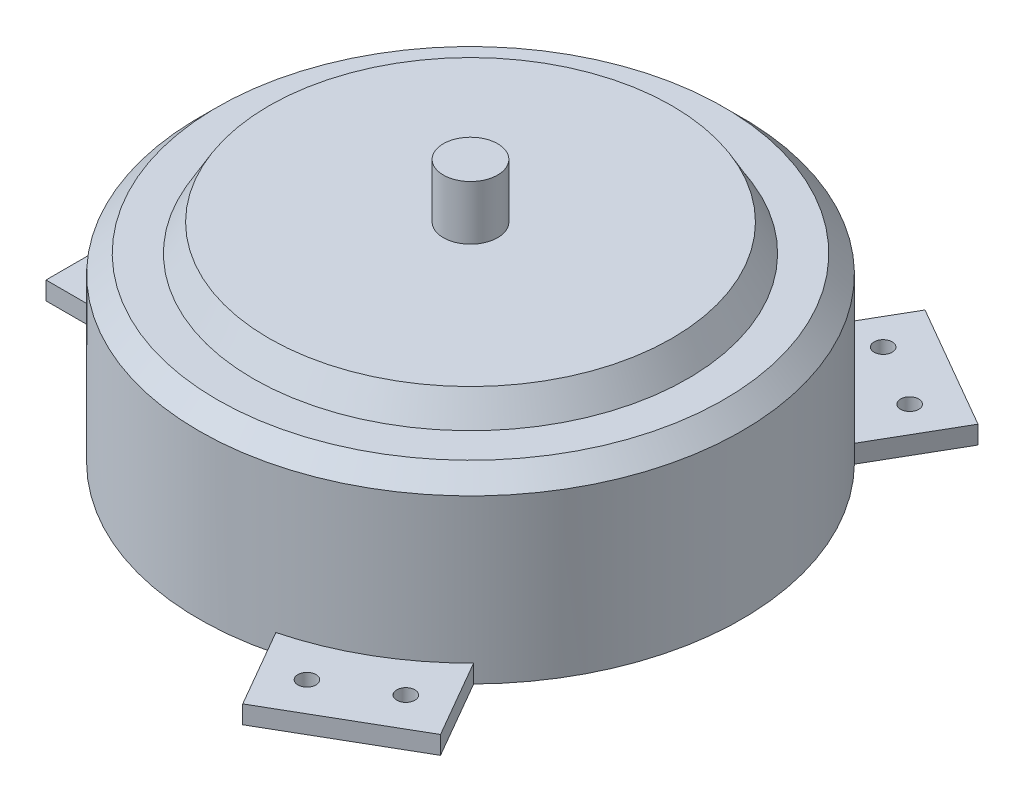
ISO-10303-21;
HEADER;
FILE_DESCRIPTION(('STEP AP214'),'2;1');
FILE_NAME('part.step','',(''),(''),'','','');
FILE_SCHEMA(('AUTOMOTIVE_DESIGN { 1 0 10303 214 1 1 1 1 }'));
ENDSEC;
DATA;
#1=APPLICATION_CONTEXT('core data for automotive mechanical design processes');
#2=APPLICATION_PROTOCOL_DEFINITION('international standard','automotive_design',2000,#1);
#3=PRODUCT_CONTEXT('',#1,'mechanical');
#4=PRODUCT('Part','Part','',(#3));
#5=PRODUCT_RELATED_PRODUCT_CATEGORY('part','',(#4));
#6=PRODUCT_DEFINITION_FORMATION('','',#4);
#7=PRODUCT_DEFINITION_CONTEXT('part definition',#1,'design');
#8=PRODUCT_DEFINITION('design','',#6,#7);
#9=PRODUCT_DEFINITION_SHAPE('','',#8);
#10=(LENGTH_UNIT() NAMED_UNIT(*) SI_UNIT(.MILLI.,.METRE.));
#11=(NAMED_UNIT(*) PLANE_ANGLE_UNIT() SI_UNIT($,.RADIAN.));
#12=(NAMED_UNIT(*) SI_UNIT($,.STERADIAN.) SOLID_ANGLE_UNIT());
#13=UNCERTAINTY_MEASURE_WITH_UNIT(LENGTH_MEASURE(1.E-05),#10,'distance_accuracy_value','');
#14=(GEOMETRIC_REPRESENTATION_CONTEXT(3) GLOBAL_UNCERTAINTY_ASSIGNED_CONTEXT((#13)) GLOBAL_UNIT_ASSIGNED_CONTEXT((#10,
#11,#12)) REPRESENTATION_CONTEXT('',''));
#15=CARTESIAN_POINT('',(0.,0.,0.));
#16=DIRECTION('',(0.,0.,1.));
#17=DIRECTION('',(1.,0.,0.));
#18=AXIS2_PLACEMENT_3D('',#15,#16,#17);
#19=CARTESIAN_POINT('',(0.,100.,0.));
#20=DIRECTION('',(0.,-1.,0.));
#21=DIRECTION('',(0.,0.,-1.));
#22=AXIS2_PLACEMENT_3D('',#19,#20,#21);
#23=CYLINDRICAL_SURFACE('',#22,150.);
#24=CARTESIAN_POINT('',(0.,89.9999999999999,0.));
#25=DIRECTION('',(0.,1.,0.));
#26=DIRECTION('',(0.,0.,1.));
#27=AXIS2_PLACEMENT_3D('',#24,#25,#26);
#28=CIRCLE('',#27,150.);
#29=CARTESIAN_POINT('',(0.,89.9999999999999,150.));
#30=VERTEX_POINT('',#29);
#31=EDGE_CURVE('E52',#30,#30,#28,.F.);
#32=ORIENTED_EDGE('',*,*,#31,.T.);
#33=EDGE_LOOP('',(#32));
#34=FACE_BOUND('',#33,.T.);
#35=DIRECTION('',(0.,-1.,0.));
#36=VECTOR('',#35,1.);
#37=CARTESIAN_POINT('',(106.925177625381,10.,-105.19984025549));
#38=LINE('',#37,#36);
#39=CARTESIAN_POINT('',(106.925177625381,9.99999999999999,-105.19984025549));
#40=VERTEX_POINT('',#39);
#41=CARTESIAN_POINT('',(106.925177625381,0.,-105.19984025549));
#42=VERTEX_POINT('',#41);
#43=EDGE_CURVE('E70',#40,#42,#38,.T.);
#44=ORIENTED_EDGE('',*,*,#43,.F.);
#45=CARTESIAN_POINT('',(0.,10.,0.));
#46=DIRECTION('',(0.,1.,0.));
#47=DIRECTION('',(-0.866025403784443,0.,-0.499999999999992));
#48=AXIS2_PLACEMENT_3D('',#45,#46,#47);
#49=CIRCLE('',#48,150.);
#50=CARTESIAN_POINT('',(37.6431453226259,9.99999999999999,-145.19984025549));
#51=VERTEX_POINT('',#50);
#52=EDGE_CURVE('E65',#40,#51,#49,.T.);
#53=ORIENTED_EDGE('',*,*,#52,.T.);
#54=DIRECTION('',(0.,-1.,0.));
#55=VECTOR('',#54,1.);
#56=CARTESIAN_POINT('',(37.6431453226259,10.,-145.19984025549));
#57=LINE('',#56,#55);
#58=CARTESIAN_POINT('',(37.6431453226259,0.,-145.19984025549));
#59=VERTEX_POINT('',#58);
#60=EDGE_CURVE('E181',#51,#59,#57,.T.);
#61=ORIENTED_EDGE('',*,*,#60,.T.);
#62=CARTESIAN_POINT('',(0.,0.,0.));
#63=DIRECTION('',(0.,1.,0.));
#64=DIRECTION('',(0.,0.,1.));
#65=AXIS2_PLACEMENT_3D('',#62,#63,#64);
#66=CIRCLE('',#65,150.);
#67=CARTESIAN_POINT('',(-144.56832294801,0.,-40.));
#68=VERTEX_POINT('',#67);
#69=EDGE_CURVE('E281',#59,#68,#66,.T.);
#70=ORIENTED_EDGE('',*,*,#69,.T.);
#71=DIRECTION('',(0.,-1.,0.));
#72=VECTOR('',#71,1.);
#73=CARTESIAN_POINT('',(-144.56832294801,10.,-40.));
#74=LINE('',#73,#72);
#75=CARTESIAN_POINT('',(-144.56832294801,9.99999999999999,-40.));
#76=VERTEX_POINT('',#75);
#77=EDGE_CURVE('E257',#76,#68,#74,.T.);
#78=ORIENTED_EDGE('',*,*,#77,.F.);
#79=CARTESIAN_POINT('',(0.,10.,0.));
#80=DIRECTION('',(0.,1.,0.));
#81=DIRECTION('',(0.,0.,1.));
#82=AXIS2_PLACEMENT_3D('',#79,#80,#81);
#83=CIRCLE('',#82,150.);
#84=CARTESIAN_POINT('',(-144.56832294801,9.99999999999999,40.));
#85=VERTEX_POINT('',#84);
#86=EDGE_CURVE('E254',#76,#85,#83,.T.);
#87=ORIENTED_EDGE('',*,*,#86,.T.);
#88=DIRECTION('',(0.,-1.,0.));
#89=VECTOR('',#88,1.);
#90=CARTESIAN_POINT('',(-144.56832294801,10.,40.));
#91=LINE('',#90,#89);
#92=CARTESIAN_POINT('',(-144.56832294801,0.,40.));
#93=VERTEX_POINT('',#92);
#94=EDGE_CURVE('E271',#85,#93,#91,.T.);
#95=ORIENTED_EDGE('',*,*,#94,.T.);
#96=CARTESIAN_POINT('',(37.6431453226279,0.,145.199840255489));
#97=VERTEX_POINT('',#96);
#98=EDGE_CURVE('E282',#93,#97,#66,.T.);
#99=ORIENTED_EDGE('',*,*,#98,.T.);
#100=DIRECTION('',(0.,-1.,0.));
#101=VECTOR('',#100,1.);
#102=CARTESIAN_POINT('',(37.6431453226279,10.,145.199840255489));
#103=LINE('',#102,#101);
#104=CARTESIAN_POINT('',(37.6431453226279,9.99999999999999,145.199840255489));
#105=VERTEX_POINT('',#104);
#106=EDGE_CURVE('E201',#105,#97,#103,.T.);
#107=ORIENTED_EDGE('',*,*,#106,.F.);
#108=CARTESIAN_POINT('',(0.,10.,0.));
#109=DIRECTION('',(0.,1.,0.));
#110=DIRECTION('',(0.866025403784436,0.,-0.500000000000004));
#111=AXIS2_PLACEMENT_3D('',#108,#109,#110);
#112=CIRCLE('',#111,150.);
#113=CARTESIAN_POINT('',(106.925177625383,9.99999999999999,105.199840255489));
#114=VERTEX_POINT('',#113);
#115=EDGE_CURVE('E198',#105,#114,#112,.T.);
#116=ORIENTED_EDGE('',*,*,#115,.T.);
#117=DIRECTION('',(0.,-1.,0.));
#118=VECTOR('',#117,1.);
#119=CARTESIAN_POINT('',(106.925177625383,10.,105.199840255489));
#120=LINE('',#119,#118);
#121=CARTESIAN_POINT('',(106.925177625383,0.,105.199840255489));
#122=VERTEX_POINT('',#121);
#123=EDGE_CURVE('E215',#114,#122,#120,.T.);
#124=ORIENTED_EDGE('',*,*,#123,.T.);
#125=EDGE_CURVE('E285',#122,#42,#66,.T.);
#126=ORIENTED_EDGE('',*,*,#125,.T.);
#127=EDGE_LOOP('',(#44,#53,#61,#70,#78,#87,#95,#99,#107,#116,#124,#126));
#128=FACE_BOUND('',#127,.T.);
#129=ADVANCED_FACE('F47',(#34,#128),#23,.T.);
#130=CARTESIAN_POINT('',(0.,100.,0.));
#131=DIRECTION('',(0.,1.,0.));
#132=DIRECTION('',(0.,0.,1.));
#133=AXIS2_PLACEMENT_3D('',#130,#131,#132);
#134=PLANE('',#133);
#135=CARTESIAN_POINT('',(0.,100.,0.));
#136=DIRECTION('',(0.,1.,0.));
#137=DIRECTION('',(0.,0.,1.));
#138=AXIS2_PLACEMENT_3D('',#135,#136,#137);
#139=CIRCLE('',#138,120.);
#140=CARTESIAN_POINT('',(0.,100.,120.));
#141=VERTEX_POINT('',#140);
#142=EDGE_CURVE('E11',#141,#141,#139,.T.);
#143=ORIENTED_EDGE('',*,*,#142,.F.);
#144=EDGE_LOOP('',(#143));
#145=FACE_BOUND('',#144,.T.);
#146=CARTESIAN_POINT('',(0.,100.,0.));
#147=DIRECTION('',(0.,1.,0.));
#148=DIRECTION('',(0.,0.,1.));
#149=AXIS2_PLACEMENT_3D('',#146,#147,#148);
#150=CIRCLE('',#149,140.);
#151=CARTESIAN_POINT('',(0.,100.,140.));
#152=VERTEX_POINT('',#151);
#153=EDGE_CURVE('E284',#152,#152,#150,.T.);
#154=ORIENTED_EDGE('',*,*,#153,.T.);
#155=EDGE_LOOP('',(#154));
#156=FACE_BOUND('',#155,.T.);
#157=ADVANCED_FACE('F306',(#145,#156),#134,.T.);
#158=CARTESIAN_POINT('',(0.,0.,0.));
#159=DIRECTION('',(0.,1.,0.));
#160=DIRECTION('',(0.,0.,1.));
#161=AXIS2_PLACEMENT_3D('',#158,#159,#160);
#162=PLANE('',#161);
#163=CARTESIAN_POINT('',(103.46258881269,0.,-139.202460506189));
#164=DIRECTION('',(0.,1.,0.));
#165=DIRECTION('',(0.866025403784443,0.,0.499999999999992));
#166=AXIS2_PLACEMENT_3D('',#163,#164,#165);
#167=CIRCLE('',#166,4.99999999999999);
#168=CARTESIAN_POINT('',(107.792715831612,0.,-136.702460506189));
#169=VERTEX_POINT('',#168);
#170=EDGE_CURVE('E427',#169,#169,#167,.T.);
#171=ORIENTED_EDGE('',*,*,#170,.T.);
#172=EDGE_LOOP('',(#171));
#173=FACE_BOUND('',#172,.T.);
#174=CARTESIAN_POINT('',(68.8215726613122,0.,-159.202460506189));
#175=DIRECTION('',(0.,1.,0.));
#176=DIRECTION('',(-0.866025403784443,0.,-0.499999999999992));
#177=AXIS2_PLACEMENT_3D('',#174,#175,#176);
#178=CIRCLE('',#177,4.99999999999999);
#179=CARTESIAN_POINT('',(64.4914456423899,0.,-161.702460506189));
#180=VERTEX_POINT('',#179);
#181=EDGE_CURVE('E419',#180,#180,#178,.T.);
#182=ORIENTED_EDGE('',*,*,#181,.T.);
#183=EDGE_LOOP('',(#182));
#184=FACE_BOUND('',#183,.T.);
#185=CARTESIAN_POINT('',(68.8215726613144,0.,159.202460506188));
#186=DIRECTION('',(0.,1.,0.));
#187=DIRECTION('',(-0.866025403784436,0.,0.500000000000004));
#188=AXIS2_PLACEMENT_3D('',#185,#186,#187);
#189=CIRCLE('',#188,4.99999999999999);
#190=CARTESIAN_POINT('',(64.4914456423922,0.,161.702460506188));
#191=VERTEX_POINT('',#190);
#192=EDGE_CURVE('E410',#191,#191,#189,.T.);
#193=ORIENTED_EDGE('',*,*,#192,.T.);
#194=EDGE_LOOP('',(#193));
#195=FACE_BOUND('',#194,.T.);
#196=CARTESIAN_POINT('',(103.462588812692,0.,139.202460506188));
#197=DIRECTION('',(0.,1.,0.));
#198=DIRECTION('',(0.866025403784436,0.,-0.500000000000004));
#199=AXIS2_PLACEMENT_3D('',#196,#197,#198);
#200=CIRCLE('',#199,4.99999999999999);
#201=CARTESIAN_POINT('',(107.792715831614,0.,136.702460506188));
#202=VERTEX_POINT('',#201);
#203=EDGE_CURVE('E173',#202,#202,#200,.T.);
#204=ORIENTED_EDGE('',*,*,#203,.T.);
#205=EDGE_LOOP('',(#204));
#206=FACE_BOUND('',#205,.T.);
#207=CARTESIAN_POINT('',(-172.284161474005,0.,20.));
#208=DIRECTION('',(0.,1.,0.));
#209=DIRECTION('',(0.,0.,1.));
#210=AXIS2_PLACEMENT_3D('',#207,#208,#209);
#211=CIRCLE('',#210,4.99999999999999);
#212=CARTESIAN_POINT('',(-172.284161474005,0.,25.));
#213=VERTEX_POINT('',#212);
#214=EDGE_CURVE('E226',#213,#213,#211,.T.);
#215=ORIENTED_EDGE('',*,*,#214,.T.);
#216=EDGE_LOOP('',(#215));
#217=FACE_BOUND('',#216,.T.);
#218=CARTESIAN_POINT('',(-172.284161474005,0.,-20.));
#219=DIRECTION('',(0.,1.,0.));
#220=DIRECTION('',(0.,0.,-1.));
#221=AXIS2_PLACEMENT_3D('',#218,#219,#220);
#222=CIRCLE('',#221,4.99999999999999);
#223=CARTESIAN_POINT('',(-172.284161474005,0.,-25.));
#224=VERTEX_POINT('',#223);
#225=EDGE_CURVE('E225',#224,#224,#222,.T.);
#226=ORIENTED_EDGE('',*,*,#225,.T.);
#227=EDGE_LOOP('',(#226));
#228=FACE_BOUND('',#227,.T.);
#229=ORIENTED_EDGE('',*,*,#98,.F.);
#230=DIRECTION('',(1.,0.,0.));
#231=VECTOR('',#230,1.);
#232=CARTESIAN_POINT('',(-194.56832294801,0.,40.));
#233=LINE('',#232,#231);
#234=CARTESIAN_POINT('',(-194.56832294801,0.,40.));
#235=VERTEX_POINT('',#234);
#236=EDGE_CURVE('E246',#235,#93,#233,.T.);
#237=ORIENTED_EDGE('',*,*,#236,.F.);
#238=DIRECTION('',(0.,0.,-1.));
#239=VECTOR('',#238,1.);
#240=CARTESIAN_POINT('',(-194.56832294801,0.,40.));
#241=LINE('',#240,#239);
#242=CARTESIAN_POINT('',(-194.56832294801,0.,-40.));
#243=VERTEX_POINT('',#242);
#244=EDGE_CURVE('E261',#235,#243,#241,.T.);
#245=ORIENTED_EDGE('',*,*,#244,.T.);
#246=DIRECTION('',(-1.,0.,0.));
#247=VECTOR('',#246,1.);
#248=CARTESIAN_POINT('',(-144.56832294801,0.,-40.));
#249=LINE('',#248,#247);
#250=EDGE_CURVE('E230',#68,#243,#249,.T.);
#251=ORIENTED_EDGE('',*,*,#250,.F.);
#252=ORIENTED_EDGE('',*,*,#69,.F.);
#253=DIRECTION('',(-0.499999999999992,0.,0.866025403784443));
#254=VECTOR('',#253,1.);
#255=CARTESIAN_POINT('',(62.6431453226255,0.,-188.501110444712));
#256=LINE('',#255,#254);
#257=CARTESIAN_POINT('',(62.6431453226255,0.,-188.501110444712));
#258=VERTEX_POINT('',#257);
#259=EDGE_CURVE('E145',#258,#59,#256,.T.);
#260=ORIENTED_EDGE('',*,*,#259,.F.);
#261=DIRECTION('',(0.866025403784443,0.,0.499999999999992));
#262=VECTOR('',#261,1.);
#263=CARTESIAN_POINT('',(62.6431453226255,0.,-188.501110444712));
#264=LINE('',#263,#262);
#265=CARTESIAN_POINT('',(131.925177625381,0.,-148.501110444712));
#266=VERTEX_POINT('',#265);
#267=EDGE_CURVE('E172',#258,#266,#264,.T.);
#268=ORIENTED_EDGE('',*,*,#267,.T.);
#269=DIRECTION('',(0.499999999999992,0.,-0.866025403784443));
#270=VECTOR('',#269,1.);
#271=CARTESIAN_POINT('',(106.925177625381,0.,-105.19984025549));
#272=LINE('',#271,#270);
#273=EDGE_CURVE('E151',#42,#266,#272,.T.);
#274=ORIENTED_EDGE('',*,*,#273,.F.);
#275=ORIENTED_EDGE('',*,*,#125,.F.);
#276=DIRECTION('',(-0.500000000000004,0.,-0.866025403784436));
#277=VECTOR('',#276,1.);
#278=CARTESIAN_POINT('',(131.925177625383,0.,148.501110444711));
#279=LINE('',#278,#277);
#280=CARTESIAN_POINT('',(131.925177625383,0.,148.501110444711));
#281=VERTEX_POINT('',#280);
#282=EDGE_CURVE('E190',#281,#122,#279,.T.);
#283=ORIENTED_EDGE('',*,*,#282,.F.);
#284=DIRECTION('',(-0.866025403784436,0.,0.500000000000004));
#285=VECTOR('',#284,1.);
#286=CARTESIAN_POINT('',(131.925177625383,0.,148.501110444711));
#287=LINE('',#286,#285);
#288=CARTESIAN_POINT('',(62.6431453226282,0.,188.501110444711));
#289=VERTEX_POINT('',#288);
#290=EDGE_CURVE('E205',#281,#289,#287,.T.);
#291=ORIENTED_EDGE('',*,*,#290,.T.);
#292=DIRECTION('',(0.500000000000004,0.,0.866025403784436));
#293=VECTOR('',#292,1.);
#294=CARTESIAN_POINT('',(37.643145322628,0.,145.199840255489));
#295=LINE('',#294,#293);
#296=EDGE_CURVE('E156',#97,#289,#295,.T.);
#297=ORIENTED_EDGE('',*,*,#296,.F.);
#298=EDGE_LOOP('',(#229,#237,#245,#251,#252,#260,#268,#274,#275,#283,#291,#297));
#299=FACE_BOUND('',#298,.T.);
#300=ADVANCED_FACE('F298',(#173,#184,#195,#206,#217,#228,#299),#162,.F.);
#301=CARTESIAN_POINT('',(0.,100.,0.));
#302=DIRECTION('',(0.,-1.,0.));
#303=DIRECTION('',(0.,0.,-1.));
#304=AXIS2_PLACEMENT_3D('',#301,#302,#303);
#305=CONICAL_SURFACE('',#304,140.,0.785398163397446);
#306=ORIENTED_EDGE('',*,*,#31,.F.);
#307=EDGE_LOOP('',(#306));
#308=FACE_BOUND('',#307,.T.);
#309=ORIENTED_EDGE('',*,*,#153,.F.);
#310=EDGE_LOOP('',(#309));
#311=FACE_BOUND('',#310,.T.);
#312=ADVANCED_FACE('F50',(#308,#311),#305,.T.);
#313=CARTESIAN_POINT('',(-144.56832294801,10.,-40.));
#314=DIRECTION('',(0.,0.,1.));
#315=DIRECTION('',(1.,0.,0.));
#316=AXIS2_PLACEMENT_3D('',#313,#314,#315);
#317=PLANE('',#316);
#318=ORIENTED_EDGE('',*,*,#250,.T.);
#319=DIRECTION('',(0.,-1.,0.));
#320=VECTOR('',#319,1.);
#321=CARTESIAN_POINT('',(-194.56832294801,10.,-40.));
#322=LINE('',#321,#320);
#323=CARTESIAN_POINT('',(-194.56832294801,10.,-40.));
#324=VERTEX_POINT('',#323);
#325=EDGE_CURVE('E278',#324,#243,#322,.T.);
#326=ORIENTED_EDGE('',*,*,#325,.F.);
#327=DIRECTION('',(-1.,0.,0.));
#328=VECTOR('',#327,1.);
#329=CARTESIAN_POINT('',(-144.56832294801,10.,-40.));
#330=LINE('',#329,#328);
#331=EDGE_CURVE('E242',#76,#324,#330,.T.);
#332=ORIENTED_EDGE('',*,*,#331,.F.);
#333=ORIENTED_EDGE('',*,*,#77,.T.);
#334=EDGE_LOOP('',(#318,#326,#332,#333));
#335=FACE_BOUND('',#334,.T.);
#336=ADVANCED_FACE('F297',(#335),#317,.F.);
#337=CARTESIAN_POINT('',(-194.56832294801,10.,40.));
#338=DIRECTION('',(-1.,0.,0.));
#339=DIRECTION('',(0.,0.,1.));
#340=AXIS2_PLACEMENT_3D('',#337,#338,#339);
#341=PLANE('',#340);
#342=ORIENTED_EDGE('',*,*,#244,.F.);
#343=DIRECTION('',(0.,-1.,0.));
#344=VECTOR('',#343,1.);
#345=CARTESIAN_POINT('',(-194.56832294801,10.,40.));
#346=LINE('',#345,#344);
#347=CARTESIAN_POINT('',(-194.56832294801,10.,40.));
#348=VERTEX_POINT('',#347);
#349=EDGE_CURVE('E275',#348,#235,#346,.T.);
#350=ORIENTED_EDGE('',*,*,#349,.F.);
#351=DIRECTION('',(0.,0.,-1.));
#352=VECTOR('',#351,1.);
#353=CARTESIAN_POINT('',(-194.56832294801,10.,40.));
#354=LINE('',#353,#352);
#355=EDGE_CURVE('E245',#348,#324,#354,.T.);
#356=ORIENTED_EDGE('',*,*,#355,.T.);
#357=ORIENTED_EDGE('',*,*,#325,.T.);
#358=EDGE_LOOP('',(#342,#350,#356,#357));
#359=FACE_BOUND('',#358,.T.);
#360=ADVANCED_FACE('F302',(#359),#341,.T.);
#361=CARTESIAN_POINT('',(-194.56832294801,10.,40.));
#362=DIRECTION('',(0.,0.,-1.));
#363=DIRECTION('',(-1.,0.,0.));
#364=AXIS2_PLACEMENT_3D('',#361,#362,#363);
#365=PLANE('',#364);
#366=ORIENTED_EDGE('',*,*,#236,.T.);
#367=ORIENTED_EDGE('',*,*,#94,.F.);
#368=DIRECTION('',(1.,0.,0.));
#369=VECTOR('',#368,1.);
#370=CARTESIAN_POINT('',(-194.56832294801,10.,40.));
#371=LINE('',#370,#369);
#372=EDGE_CURVE('E250',#348,#85,#371,.T.);
#373=ORIENTED_EDGE('',*,*,#372,.F.);
#374=ORIENTED_EDGE('',*,*,#349,.T.);
#375=EDGE_LOOP('',(#366,#367,#373,#374));
#376=FACE_BOUND('',#375,.T.);
#377=ADVANCED_FACE('F319',(#376),#365,.F.);
#378=CARTESIAN_POINT('',(0.,10.,0.));
#379=DIRECTION('',(0.,1.,0.));
#380=DIRECTION('',(0.,0.,1.));
#381=AXIS2_PLACEMENT_3D('',#378,#379,#380);
#382=PLANE('',#381);
#383=CARTESIAN_POINT('',(-172.284161474005,10.,20.));
#384=DIRECTION('',(0.,1.,0.));
#385=DIRECTION('',(0.,0.,1.));
#386=AXIS2_PLACEMENT_3D('',#383,#384,#385);
#387=CIRCLE('',#386,4.99999999999999);
#388=CARTESIAN_POINT('',(-172.284161474005,10.,25.));
#389=VERTEX_POINT('',#388);
#390=EDGE_CURVE('E231',#389,#389,#387,.T.);
#391=ORIENTED_EDGE('',*,*,#390,.F.);
#392=EDGE_LOOP('',(#391));
#393=FACE_BOUND('',#392,.T.);
#394=CARTESIAN_POINT('',(-172.284161474005,10.,-20.));
#395=DIRECTION('',(0.,1.,0.));
#396=DIRECTION('',(0.,0.,-1.));
#397=AXIS2_PLACEMENT_3D('',#394,#395,#396);
#398=CIRCLE('',#397,4.99999999999999);
#399=CARTESIAN_POINT('',(-172.284161474005,10.,-25.));
#400=VERTEX_POINT('',#399);
#401=EDGE_CURVE('E235',#400,#400,#398,.T.);
#402=ORIENTED_EDGE('',*,*,#401,.F.);
#403=EDGE_LOOP('',(#402));
#404=FACE_BOUND('',#403,.T.);
#405=ORIENTED_EDGE('',*,*,#331,.T.);
#406=ORIENTED_EDGE('',*,*,#355,.F.);
#407=ORIENTED_EDGE('',*,*,#372,.T.);
#408=ORIENTED_EDGE('',*,*,#86,.F.);
#409=EDGE_LOOP('',(#405,#406,#407,#408));
#410=FACE_BOUND('',#409,.T.);
#411=ADVANCED_FACE('F323',(#393,#404,#410),#382,.T.);
#412=CARTESIAN_POINT('',(-172.284161474005,0.,-20.));
#413=DIRECTION('',(0.,1.,0.));
#414=DIRECTION('',(0.,0.,1.));
#415=AXIS2_PLACEMENT_3D('',#412,#413,#414);
#416=CYLINDRICAL_SURFACE('',#415,4.99999999999999);
#417=ORIENTED_EDGE('',*,*,#225,.F.);
#418=EDGE_LOOP('',(#417));
#419=FACE_BOUND('',#418,.T.);
#420=ORIENTED_EDGE('',*,*,#401,.T.);
#421=EDGE_LOOP('',(#420));
#422=FACE_BOUND('',#421,.T.);
#423=ADVANCED_FACE('F327',(#419,#422),#416,.F.);
#424=CARTESIAN_POINT('',(-172.284161474005,0.,20.));
#425=DIRECTION('',(0.,1.,0.));
#426=DIRECTION('',(0.,0.,1.));
#427=AXIS2_PLACEMENT_3D('',#424,#425,#426);
#428=CYLINDRICAL_SURFACE('',#427,4.99999999999999);
#429=ORIENTED_EDGE('',*,*,#214,.F.);
#430=EDGE_LOOP('',(#429));
#431=FACE_BOUND('',#430,.T.);
#432=ORIENTED_EDGE('',*,*,#390,.T.);
#433=EDGE_LOOP('',(#432));
#434=FACE_BOUND('',#433,.T.);
#435=ADVANCED_FACE('F331',(#431,#434),#428,.F.);
#436=CARTESIAN_POINT('',(37.643145322628,10.,145.199840255489));
#437=DIRECTION('',(0.866025403784436,0.,-0.500000000000004));
#438=DIRECTION('',(-0.500000000000004,0.,-0.866025403784436));
#439=AXIS2_PLACEMENT_3D('',#436,#437,#438);
#440=PLANE('',#439);
#441=ORIENTED_EDGE('',*,*,#296,.T.);
#442=DIRECTION('',(0.,-1.,0.));
#443=VECTOR('',#442,1.);
#444=CARTESIAN_POINT('',(62.6431453226282,10.,188.501110444711));
#445=LINE('',#444,#443);
#446=CARTESIAN_POINT('',(62.6431453226282,10.,188.501110444711));
#447=VERTEX_POINT('',#446);
#448=EDGE_CURVE('E222',#447,#289,#445,.T.);
#449=ORIENTED_EDGE('',*,*,#448,.F.);
#450=DIRECTION('',(0.500000000000004,0.,0.866025403784436));
#451=VECTOR('',#450,1.);
#452=CARTESIAN_POINT('',(37.643145322628,10.,145.199840255489));
#453=LINE('',#452,#451);
#454=EDGE_CURVE('E186',#105,#447,#453,.T.);
#455=ORIENTED_EDGE('',*,*,#454,.F.);
#456=ORIENTED_EDGE('',*,*,#106,.T.);
#457=EDGE_LOOP('',(#441,#449,#455,#456));
#458=FACE_BOUND('',#457,.T.);
#459=ADVANCED_FACE('F334',(#458),#440,.F.);
#460=CARTESIAN_POINT('',(131.925177625383,10.,148.501110444711));
#461=DIRECTION('',(0.500000000000004,0.,0.866025403784436));
#462=DIRECTION('',(0.866025403784436,0.,-0.500000000000004));
#463=AXIS2_PLACEMENT_3D('',#460,#461,#462);
#464=PLANE('',#463);
#465=ORIENTED_EDGE('',*,*,#290,.F.);
#466=DIRECTION('',(0.,-1.,0.));
#467=VECTOR('',#466,1.);
#468=CARTESIAN_POINT('',(131.925177625383,10.,148.501110444711));
#469=LINE('',#468,#467);
#470=CARTESIAN_POINT('',(131.925177625383,10.,148.501110444711));
#471=VERTEX_POINT('',#470);
#472=EDGE_CURVE('E219',#471,#281,#469,.T.);
#473=ORIENTED_EDGE('',*,*,#472,.F.);
#474=DIRECTION('',(-0.866025403784436,0.,0.500000000000004));
#475=VECTOR('',#474,1.);
#476=CARTESIAN_POINT('',(131.925177625383,10.,148.501110444711));
#477=LINE('',#476,#475);
#478=EDGE_CURVE('E189',#471,#447,#477,.T.);
#479=ORIENTED_EDGE('',*,*,#478,.T.);
#480=ORIENTED_EDGE('',*,*,#448,.T.);
#481=EDGE_LOOP('',(#465,#473,#479,#480));
#482=FACE_BOUND('',#481,.T.);
#483=ADVANCED_FACE('F338',(#482),#464,.T.);
#484=CARTESIAN_POINT('',(131.925177625383,10.,148.501110444711));
#485=DIRECTION('',(-0.866025403784436,0.,0.500000000000004));
#486=DIRECTION('',(0.500000000000004,0.,0.866025403784436));
#487=AXIS2_PLACEMENT_3D('',#484,#485,#486);
#488=PLANE('',#487);
#489=ORIENTED_EDGE('',*,*,#282,.T.);
#490=ORIENTED_EDGE('',*,*,#123,.F.);
#491=DIRECTION('',(-0.500000000000004,0.,-0.866025403784436));
#492=VECTOR('',#491,1.);
#493=CARTESIAN_POINT('',(131.925177625383,10.,148.501110444711));
#494=LINE('',#493,#492);
#495=EDGE_CURVE('E194',#471,#114,#494,.T.);
#496=ORIENTED_EDGE('',*,*,#495,.F.);
#497=ORIENTED_EDGE('',*,*,#472,.T.);
#498=EDGE_LOOP('',(#489,#490,#496,#497));
#499=FACE_BOUND('',#498,.T.);
#500=ADVANCED_FACE('F342',(#499),#488,.F.);
#501=CARTESIAN_POINT('',(0.,10.,0.));
#502=DIRECTION('',(0.,1.,0.));
#503=DIRECTION('',(0.866025403784436,0.,-0.500000000000004));
#504=AXIS2_PLACEMENT_3D('',#501,#502,#503);
#505=PLANE('',#504);
#506=CARTESIAN_POINT('',(68.8215726613144,10.,159.202460506188));
#507=DIRECTION('',(0.,1.,0.));
#508=DIRECTION('',(-0.866025403784436,0.,0.500000000000004));
#509=AXIS2_PLACEMENT_3D('',#506,#507,#508);
#510=CIRCLE('',#509,4.99999999999999);
#511=CARTESIAN_POINT('',(64.4914456423922,10.,161.702460506188));
#512=VERTEX_POINT('',#511);
#513=EDGE_CURVE('E415',#512,#512,#510,.T.);
#514=ORIENTED_EDGE('',*,*,#513,.F.);
#515=EDGE_LOOP('',(#514));
#516=FACE_BOUND('',#515,.T.);
#517=CARTESIAN_POINT('',(103.462588812692,10.,139.202460506188));
#518=DIRECTION('',(0.,1.,0.));
#519=DIRECTION('',(0.866025403784436,0.,-0.500000000000004));
#520=AXIS2_PLACEMENT_3D('',#517,#518,#519);
#521=CIRCLE('',#520,4.99999999999999);
#522=CARTESIAN_POINT('',(107.792715831614,10.,136.702460506188));
#523=VERTEX_POINT('',#522);
#524=EDGE_CURVE('E414',#523,#523,#521,.T.);
#525=ORIENTED_EDGE('',*,*,#524,.F.);
#526=EDGE_LOOP('',(#525));
#527=FACE_BOUND('',#526,.T.);
#528=ORIENTED_EDGE('',*,*,#454,.T.);
#529=ORIENTED_EDGE('',*,*,#478,.F.);
#530=ORIENTED_EDGE('',*,*,#495,.T.);
#531=ORIENTED_EDGE('',*,*,#115,.F.);
#532=EDGE_LOOP('',(#528,#529,#530,#531));
#533=FACE_BOUND('',#532,.T.);
#534=ADVANCED_FACE('F346',(#516,#527,#533),#505,.T.);
#535=CARTESIAN_POINT('',(106.925177625381,10.,-105.19984025549));
#536=DIRECTION('',(-0.866025403784443,0.,-0.499999999999992));
#537=DIRECTION('',(-0.499999999999992,0.,0.866025403784443));
#538=AXIS2_PLACEMENT_3D('',#535,#536,#537);
#539=PLANE('',#538);
#540=ORIENTED_EDGE('',*,*,#273,.T.);
#541=DIRECTION('',(0.,-1.,0.));
#542=VECTOR('',#541,1.);
#543=CARTESIAN_POINT('',(131.925177625381,10.,-148.501110444712));
#544=LINE('',#543,#542);
#545=CARTESIAN_POINT('',(131.925177625381,10.,-148.501110444712));
#546=VERTEX_POINT('',#545);
#547=EDGE_CURVE('E148',#546,#266,#544,.T.);
#548=ORIENTED_EDGE('',*,*,#547,.F.);
#549=DIRECTION('',(0.499999999999992,0.,-0.866025403784443));
#550=VECTOR('',#549,1.);
#551=CARTESIAN_POINT('',(106.925177625381,10.,-105.19984025549));
#552=LINE('',#551,#550);
#553=EDGE_CURVE('E138',#40,#546,#552,.T.);
#554=ORIENTED_EDGE('',*,*,#553,.F.);
#555=ORIENTED_EDGE('',*,*,#43,.T.);
#556=EDGE_LOOP('',(#540,#548,#554,#555));
#557=FACE_BOUND('',#556,.T.);
#558=ADVANCED_FACE('F149',(#557),#539,.F.);
#559=CARTESIAN_POINT('',(62.6431453226255,10.,-188.501110444712));
#560=DIRECTION('',(0.499999999999992,0.,-0.866025403784443));
#561=DIRECTION('',(-0.866025403784443,0.,-0.499999999999992));
#562=AXIS2_PLACEMENT_3D('',#559,#560,#561);
#563=PLANE('',#562);
#564=ORIENTED_EDGE('',*,*,#267,.F.);
#565=DIRECTION('',(0.,-1.,0.));
#566=VECTOR('',#565,1.);
#567=CARTESIAN_POINT('',(62.6431453226255,10.,-188.501110444712));
#568=LINE('',#567,#566);
#569=CARTESIAN_POINT('',(62.6431453226255,10.,-188.501110444712));
#570=VERTEX_POINT('',#569);
#571=EDGE_CURVE('E157',#570,#258,#568,.T.);
#572=ORIENTED_EDGE('',*,*,#571,.F.);
#573=DIRECTION('',(0.866025403784443,0.,0.499999999999992));
#574=VECTOR('',#573,1.);
#575=CARTESIAN_POINT('',(62.6431453226255,10.,-188.501110444712));
#576=LINE('',#575,#574);
#577=EDGE_CURVE('E142',#570,#546,#576,.T.);
#578=ORIENTED_EDGE('',*,*,#577,.T.);
#579=ORIENTED_EDGE('',*,*,#547,.T.);
#580=EDGE_LOOP('',(#564,#572,#578,#579));
#581=FACE_BOUND('',#580,.T.);
#582=ADVANCED_FACE('F159',(#581),#563,.T.);
#583=CARTESIAN_POINT('',(62.6431453226255,10.,-188.501110444712));
#584=DIRECTION('',(0.866025403784443,0.,0.499999999999992));
#585=DIRECTION('',(0.499999999999992,0.,-0.866025403784443));
#586=AXIS2_PLACEMENT_3D('',#583,#584,#585);
#587=PLANE('',#586);
#588=ORIENTED_EDGE('',*,*,#259,.T.);
#589=ORIENTED_EDGE('',*,*,#60,.F.);
#590=DIRECTION('',(-0.499999999999992,0.,0.866025403784443));
#591=VECTOR('',#590,1.);
#592=CARTESIAN_POINT('',(62.6431453226255,10.,-188.501110444712));
#593=LINE('',#592,#591);
#594=EDGE_CURVE('E162',#570,#51,#593,.T.);
#595=ORIENTED_EDGE('',*,*,#594,.F.);
#596=ORIENTED_EDGE('',*,*,#571,.T.);
#597=EDGE_LOOP('',(#588,#589,#595,#596));
#598=FACE_BOUND('',#597,.T.);
#599=ADVANCED_FACE('F355',(#598),#587,.F.);
#600=CARTESIAN_POINT('',(0.,10.,0.));
#601=DIRECTION('',(0.,1.,0.));
#602=DIRECTION('',(-0.866025403784443,0.,-0.499999999999992));
#603=AXIS2_PLACEMENT_3D('',#600,#601,#602);
#604=PLANE('',#603);
#605=CARTESIAN_POINT('',(103.46258881269,10.,-139.202460506189));
#606=DIRECTION('',(0.,1.,0.));
#607=DIRECTION('',(0.866025403784443,0.,0.499999999999992));
#608=AXIS2_PLACEMENT_3D('',#605,#606,#607);
#609=CIRCLE('',#608,4.99999999999999);
#610=CARTESIAN_POINT('',(107.792715831612,10.,-136.702460506189));
#611=VERTEX_POINT('',#610);
#612=EDGE_CURVE('E405',#611,#611,#609,.T.);
#613=ORIENTED_EDGE('',*,*,#612,.F.);
#614=EDGE_LOOP('',(#613));
#615=FACE_BOUND('',#614,.T.);
#616=CARTESIAN_POINT('',(68.8215726613122,10.,-159.202460506189));
#617=DIRECTION('',(0.,1.,0.));
#618=DIRECTION('',(-0.866025403784443,0.,-0.499999999999992));
#619=AXIS2_PLACEMENT_3D('',#616,#617,#618);
#620=CIRCLE('',#619,4.99999999999999);
#621=CARTESIAN_POINT('',(64.4914456423899,10.,-161.702460506189));
#622=VERTEX_POINT('',#621);
#623=EDGE_CURVE('E423',#622,#622,#620,.T.);
#624=ORIENTED_EDGE('',*,*,#623,.F.);
#625=EDGE_LOOP('',(#624));
#626=FACE_BOUND('',#625,.T.);
#627=ORIENTED_EDGE('',*,*,#553,.T.);
#628=ORIENTED_EDGE('',*,*,#577,.F.);
#629=ORIENTED_EDGE('',*,*,#594,.T.);
#630=ORIENTED_EDGE('',*,*,#52,.F.);
#631=EDGE_LOOP('',(#627,#628,#629,#630));
#632=FACE_BOUND('',#631,.T.);
#633=ADVANCED_FACE('F140',(#615,#626,#632),#604,.T.);
#634=CARTESIAN_POINT('',(68.8215726613122,0.,-159.202460506189));
#635=DIRECTION('',(0.,1.,0.));
#636=DIRECTION('',(0.,0.,1.));
#637=AXIS2_PLACEMENT_3D('',#634,#635,#636);
#638=CYLINDRICAL_SURFACE('',#637,4.99999999999999);
#639=ORIENTED_EDGE('',*,*,#181,.F.);
#640=EDGE_LOOP('',(#639));
#641=FACE_BOUND('',#640,.T.);
#642=ORIENTED_EDGE('',*,*,#623,.T.);
#643=EDGE_LOOP('',(#642));
#644=FACE_BOUND('',#643,.T.);
#645=ADVANCED_FACE('F361',(#641,#644),#638,.F.);
#646=CARTESIAN_POINT('',(103.46258881269,0.,-139.202460506189));
#647=DIRECTION('',(0.,1.,0.));
#648=DIRECTION('',(0.,0.,1.));
#649=AXIS2_PLACEMENT_3D('',#646,#647,#648);
#650=CYLINDRICAL_SURFACE('',#649,4.99999999999999);
#651=ORIENTED_EDGE('',*,*,#170,.F.);
#652=EDGE_LOOP('',(#651));
#653=FACE_BOUND('',#652,.T.);
#654=ORIENTED_EDGE('',*,*,#612,.T.);
#655=EDGE_LOOP('',(#654));
#656=FACE_BOUND('',#655,.T.);
#657=ADVANCED_FACE('F367',(#653,#656),#650,.F.);
#658=CARTESIAN_POINT('',(103.462588812692,0.,139.202460506188));
#659=DIRECTION('',(0.,1.,0.));
#660=DIRECTION('',(0.,0.,1.));
#661=AXIS2_PLACEMENT_3D('',#658,#659,#660);
#662=CYLINDRICAL_SURFACE('',#661,4.99999999999999);
#663=ORIENTED_EDGE('',*,*,#203,.F.);
#664=EDGE_LOOP('',(#663));
#665=FACE_BOUND('',#664,.T.);
#666=ORIENTED_EDGE('',*,*,#524,.T.);
#667=EDGE_LOOP('',(#666));
#668=FACE_BOUND('',#667,.T.);
#669=ADVANCED_FACE('F363',(#665,#668),#662,.F.);
#670=CARTESIAN_POINT('',(68.8215726613144,0.,159.202460506188));
#671=DIRECTION('',(0.,1.,0.));
#672=DIRECTION('',(0.,0.,1.));
#673=AXIS2_PLACEMENT_3D('',#670,#671,#672);
#674=CYLINDRICAL_SURFACE('',#673,4.99999999999999);
#675=ORIENTED_EDGE('',*,*,#192,.F.);
#676=EDGE_LOOP('',(#675));
#677=FACE_BOUND('',#676,.T.);
#678=ORIENTED_EDGE('',*,*,#513,.T.);
#679=EDGE_LOOP('',(#678));
#680=FACE_BOUND('',#679,.T.);
#681=ADVANCED_FACE('F366',(#677,#680),#674,.F.);
#682=CARTESIAN_POINT('',(0.,100.,0.));
#683=DIRECTION('',(0.,-1.,0.));
#684=DIRECTION('',(0.,0.,1.));
#685=AXIS2_PLACEMENT_3D('',#682,#683,#684);
#686=CONICAL_SURFACE('',#685,120.,0.5235987755983);
#687=CARTESIAN_POINT('',(0.,115.,0.));
#688=DIRECTION('',(0.,1.,0.));
#689=DIRECTION('',(0.,0.,1.));
#690=AXIS2_PLACEMENT_3D('',#687,#688,#689);
#691=CIRCLE('',#690,111.339745962156);
#692=CARTESIAN_POINT('',(0.,115.,111.339745962156));
#693=VERTEX_POINT('',#692);
#694=EDGE_CURVE('E399',#693,#693,#691,.T.);
#695=ORIENTED_EDGE('',*,*,#694,.F.);
#696=EDGE_LOOP('',(#695));
#697=FACE_BOUND('',#696,.T.);
#698=ORIENTED_EDGE('',*,*,#142,.T.);
#699=EDGE_LOOP('',(#698));
#700=FACE_BOUND('',#699,.T.);
#701=ADVANCED_FACE('F377',(#697,#700),#686,.T.);
#702=CARTESIAN_POINT('',(0.,115.,0.));
#703=DIRECTION('',(0.,1.,0.));
#704=DIRECTION('',(0.,0.,1.));
#705=AXIS2_PLACEMENT_3D('',#702,#703,#704);
#706=PLANE('',#705);
#707=CARTESIAN_POINT('',(0.,115.,0.));
#708=DIRECTION('',(0.,1.,0.));
#709=DIRECTION('',(0.,0.,1.));
#710=AXIS2_PLACEMENT_3D('',#707,#708,#709);
#711=CIRCLE('',#710,15.);
#712=CARTESIAN_POINT('',(0.,115.,15.));
#713=VERTEX_POINT('',#712);
#714=EDGE_CURVE('E400',#713,#713,#711,.T.);
#715=ORIENTED_EDGE('',*,*,#714,.F.);
#716=EDGE_LOOP('',(#715));
#717=FACE_BOUND('',#716,.T.);
#718=ORIENTED_EDGE('',*,*,#694,.T.);
#719=EDGE_LOOP('',(#718));
#720=FACE_BOUND('',#719,.T.);
#721=ADVANCED_FACE('F381',(#717,#720),#706,.T.);
#722=CARTESIAN_POINT('',(0.,145.,0.));
#723=DIRECTION('',(0.,-1.,0.));
#724=DIRECTION('',(0.,0.,-1.));
#725=AXIS2_PLACEMENT_3D('',#722,#723,#724);
#726=CYLINDRICAL_SURFACE('',#725,15.);
#727=CARTESIAN_POINT('',(0.,145.,0.));
#728=DIRECTION('',(0.,1.,0.));
#729=DIRECTION('',(0.,0.,1.));
#730=AXIS2_PLACEMENT_3D('',#727,#728,#729);
#731=CIRCLE('',#730,15.);
#732=CARTESIAN_POINT('',(0.,145.,15.));
#733=VERTEX_POINT('',#732);
#734=EDGE_CURVE('E397',#733,#733,#731,.T.);
#735=ORIENTED_EDGE('',*,*,#734,.F.);
#736=EDGE_LOOP('',(#735));
#737=FACE_BOUND('',#736,.T.);
#738=ORIENTED_EDGE('',*,*,#714,.T.);
#739=EDGE_LOOP('',(#738));
#740=FACE_BOUND('',#739,.T.);
#741=ADVANCED_FACE('F385',(#737,#740),#726,.T.);
#742=CARTESIAN_POINT('',(0.,145.,0.));
#743=DIRECTION('',(0.,1.,0.));
#744=DIRECTION('',(0.,0.,1.));
#745=AXIS2_PLACEMENT_3D('',#742,#743,#744);
#746=PLANE('',#745);
#747=ORIENTED_EDGE('',*,*,#734,.T.);
#748=EDGE_LOOP('',(#747));
#749=FACE_BOUND('',#748,.T.);
#750=ADVANCED_FACE('F389',(#749),#746,.T.);
#751=CLOSED_SHELL('',(#129,#157,#300,#312,#336,#360,#377,#411,#423,#435,#459,#483,#500,#534,
#558,#582,#599,#633,#645,#657,#669,#681,#701,#721,#741,#750));
#752=MANIFOLD_SOLID_BREP('B2',#751);
#753=ADVANCED_BREP_SHAPE_REPRESENTATION('',(#18,#752),#14);
#754=SHAPE_DEFINITION_REPRESENTATION(#9,#753);
ENDSEC;
END-ISO-10303-21;
